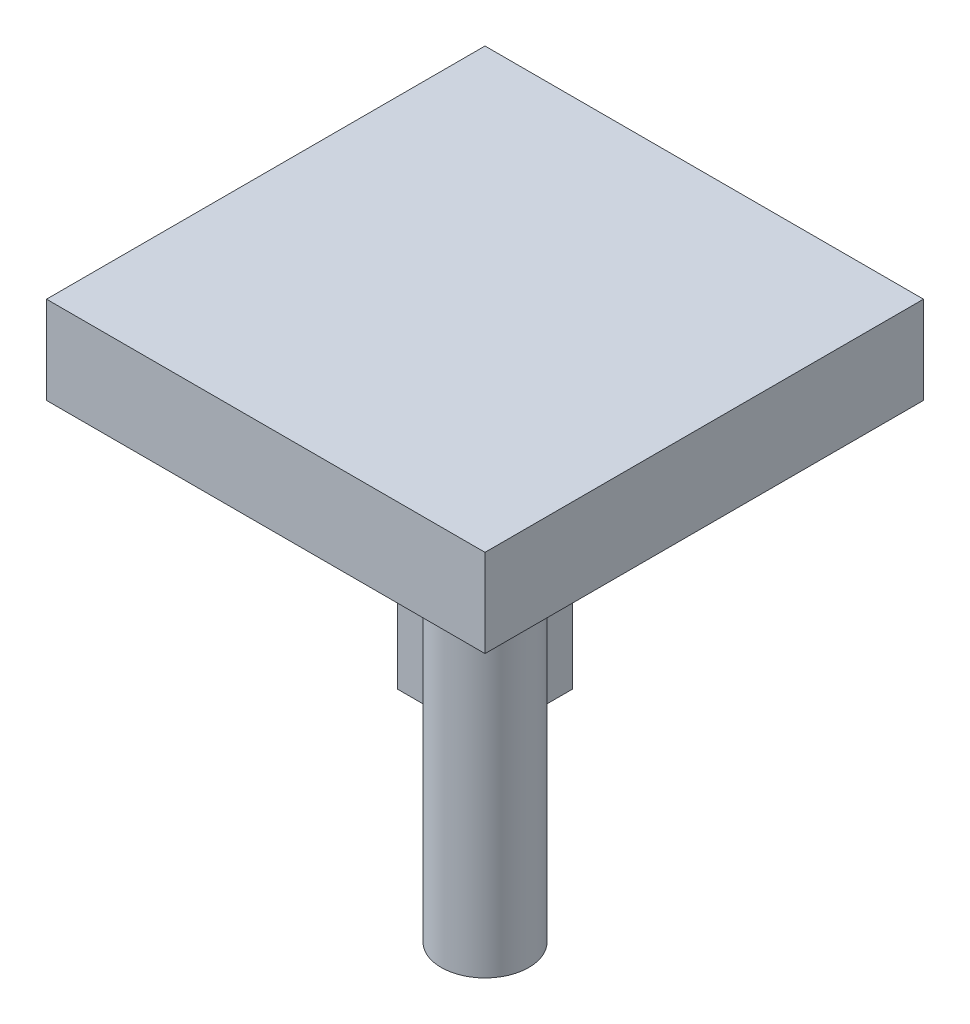
ISO-10303-21;
HEADER;
FILE_DESCRIPTION(('STEP AP214'),'2;1');
FILE_NAME('part.step','',(''),(''),'','','');
FILE_SCHEMA(('AUTOMOTIVE_DESIGN { 1 0 10303 214 1 1 1 1 }'));
ENDSEC;
DATA;
#1=APPLICATION_CONTEXT('core data for automotive mechanical design processes');
#2=APPLICATION_PROTOCOL_DEFINITION('international standard','automotive_design',2000,#1);
#3=PRODUCT_CONTEXT('',#1,'mechanical');
#4=PRODUCT('Part','Part','',(#3));
#5=PRODUCT_RELATED_PRODUCT_CATEGORY('part','',(#4));
#6=PRODUCT_DEFINITION_FORMATION('','',#4);
#7=PRODUCT_DEFINITION_CONTEXT('part definition',#1,'design');
#8=PRODUCT_DEFINITION('design','',#6,#7);
#9=PRODUCT_DEFINITION_SHAPE('','',#8);
#10=(LENGTH_UNIT() NAMED_UNIT(*) SI_UNIT(.MILLI.,.METRE.));
#11=(NAMED_UNIT(*) PLANE_ANGLE_UNIT() SI_UNIT($,.RADIAN.));
#12=(NAMED_UNIT(*) SI_UNIT($,.STERADIAN.) SOLID_ANGLE_UNIT());
#13=UNCERTAINTY_MEASURE_WITH_UNIT(LENGTH_MEASURE(1.E-05),#10,'distance_accuracy_value','');
#14=(GEOMETRIC_REPRESENTATION_CONTEXT(3) GLOBAL_UNCERTAINTY_ASSIGNED_CONTEXT((#13)) GLOBAL_UNIT_ASSIGNED_CONTEXT((#10,
#11,#12)) REPRESENTATION_CONTEXT('',''));
#15=CARTESIAN_POINT('',(0.,0.,0.));
#16=DIRECTION('',(0.,0.,1.));
#17=DIRECTION('',(1.,0.,0.));
#18=AXIS2_PLACEMENT_3D('',#15,#16,#17);
#19=CARTESIAN_POINT('',(-15.,-2.,-35.));
#20=DIRECTION('',(1.,0.,0.));
#21=DIRECTION('',(0.,0.,-1.));
#22=AXIS2_PLACEMENT_3D('',#19,#20,#21);
#23=PLANE('',#22);
#24=DIRECTION('',(0.,0.,1.));
#25=VECTOR('',#24,1.);
#26=CARTESIAN_POINT('',(-15.,-82.,-35.));
#27=LINE('',#26,#25);
#28=CARTESIAN_POINT('',(-15.,-82.,-35.));
#29=VERTEX_POINT('',#28);
#30=CARTESIAN_POINT('',(-15.,-82.,-15.));
#31=VERTEX_POINT('',#30);
#32=EDGE_CURVE('E52',#29,#31,#27,.T.);
#33=ORIENTED_EDGE('',*,*,#32,.F.);
#34=DIRECTION('',(0.,-1.,0.));
#35=VECTOR('',#34,1.);
#36=CARTESIAN_POINT('',(-15.,-2.,-35.));
#37=LINE('',#36,#35);
#38=CARTESIAN_POINT('',(-15.,-2.,-35.));
#39=VERTEX_POINT('',#38);
#40=EDGE_CURVE('E60',#39,#29,#37,.T.);
#41=ORIENTED_EDGE('',*,*,#40,.F.);
#42=DIRECTION('',(0.,0.,1.));
#43=VECTOR('',#42,1.);
#44=CARTESIAN_POINT('',(-15.,-2.,-35.));
#45=LINE('',#44,#43);
#46=CARTESIAN_POINT('',(-15.,-2.,-15.));
#47=VERTEX_POINT('',#46);
#48=EDGE_CURVE('E12',#39,#47,#45,.T.);
#49=ORIENTED_EDGE('',*,*,#48,.T.);
#50=DIRECTION('',(0.,-1.,0.));
#51=VECTOR('',#50,1.);
#52=CARTESIAN_POINT('',(-15.,-2.,-15.));
#53=LINE('',#52,#51);
#54=EDGE_CURVE('E89',#47,#31,#53,.T.);
#55=ORIENTED_EDGE('',*,*,#54,.T.);
#56=EDGE_LOOP('',(#33,#41,#49,#55));
#57=FACE_BOUND('',#56,.T.);
#58=ADVANCED_FACE('F44',(#57),#23,.T.);
#59=CARTESIAN_POINT('',(-35.,-2.,-15.));
#60=DIRECTION('',(0.,0.,1.));
#61=DIRECTION('',(1.,0.,0.));
#62=AXIS2_PLACEMENT_3D('',#59,#60,#61);
#63=PLANE('',#62);
#64=DIRECTION('',(-1.,0.,0.));
#65=VECTOR('',#64,1.);
#66=CARTESIAN_POINT('',(-35.,-82.,-15.));
#67=LINE('',#66,#65);
#68=CARTESIAN_POINT('',(-35.,-82.,-15.));
#69=VERTEX_POINT('',#68);
#70=EDGE_CURVE('E94',#31,#69,#67,.T.);
#71=ORIENTED_EDGE('',*,*,#70,.F.);
#72=ORIENTED_EDGE('',*,*,#54,.F.);
#73=DIRECTION('',(-1.,0.,0.));
#74=VECTOR('',#73,1.);
#75=CARTESIAN_POINT('',(-35.,-2.,-15.));
#76=LINE('',#75,#74);
#77=CARTESIAN_POINT('',(-35.,-2.,-15.));
#78=VERTEX_POINT('',#77);
#79=EDGE_CURVE('E92',#47,#78,#76,.T.);
#80=ORIENTED_EDGE('',*,*,#79,.T.);
#81=DIRECTION('',(0.,-1.,0.));
#82=VECTOR('',#81,1.);
#83=CARTESIAN_POINT('',(-35.,-2.,-15.));
#84=LINE('',#83,#82);
#85=EDGE_CURVE('E46',#78,#69,#84,.T.);
#86=ORIENTED_EDGE('',*,*,#85,.T.);
#87=EDGE_LOOP('',(#71,#72,#80,#86));
#88=FACE_BOUND('',#87,.T.);
#89=ADVANCED_FACE('F91',(#88),#63,.T.);
#90=CARTESIAN_POINT('',(-35.,-2.,-35.));
#91=DIRECTION('',(-1.,0.,0.));
#92=DIRECTION('',(0.,0.,1.));
#93=AXIS2_PLACEMENT_3D('',#90,#91,#92);
#94=PLANE('',#93);
#95=DIRECTION('',(0.,0.,-1.));
#96=VECTOR('',#95,1.);
#97=CARTESIAN_POINT('',(-35.,-82.,-35.));
#98=LINE('',#97,#96);
#99=CARTESIAN_POINT('',(-35.,-82.,-35.));
#100=VERTEX_POINT('',#99);
#101=EDGE_CURVE('E118',#69,#100,#98,.T.);
#102=ORIENTED_EDGE('',*,*,#101,.F.);
#103=ORIENTED_EDGE('',*,*,#85,.F.);
#104=DIRECTION('',(0.,0.,-1.));
#105=VECTOR('',#104,1.);
#106=CARTESIAN_POINT('',(-35.,-2.,-35.));
#107=LINE('',#106,#105);
#108=CARTESIAN_POINT('',(-35.,-2.,-35.));
#109=VERTEX_POINT('',#108);
#110=EDGE_CURVE('E125',#78,#109,#107,.T.);
#111=ORIENTED_EDGE('',*,*,#110,.T.);
#112=DIRECTION('',(0.,-1.,0.));
#113=VECTOR('',#112,1.);
#114=CARTESIAN_POINT('',(-35.,-2.,-35.));
#115=LINE('',#114,#113);
#116=EDGE_CURVE('E77',#109,#100,#115,.T.);
#117=ORIENTED_EDGE('',*,*,#116,.T.);
#118=EDGE_LOOP('',(#102,#103,#111,#117));
#119=FACE_BOUND('',#118,.T.);
#120=ADVANCED_FACE('F103',(#119),#94,.T.);
#121=CARTESIAN_POINT('',(-35.,-2.,-35.));
#122=DIRECTION('',(0.,0.,-1.));
#123=DIRECTION('',(-1.,0.,0.));
#124=AXIS2_PLACEMENT_3D('',#121,#122,#123);
#125=PLANE('',#124);
#126=DIRECTION('',(1.,0.,0.));
#127=VECTOR('',#126,1.);
#128=CARTESIAN_POINT('',(-35.,-82.,-35.));
#129=LINE('',#128,#127);
#130=EDGE_CURVE('E113',#100,#29,#129,.T.);
#131=ORIENTED_EDGE('',*,*,#130,.F.);
#132=ORIENTED_EDGE('',*,*,#116,.F.);
#133=DIRECTION('',(1.,0.,0.));
#134=VECTOR('',#133,1.);
#135=CARTESIAN_POINT('',(-35.,-2.,-35.));
#136=LINE('',#135,#134);
#137=EDGE_CURVE('E126',#109,#39,#136,.T.);
#138=ORIENTED_EDGE('',*,*,#137,.T.);
#139=ORIENTED_EDGE('',*,*,#40,.T.);
#140=EDGE_LOOP('',(#131,#132,#138,#139));
#141=FACE_BOUND('',#140,.T.);
#142=ADVANCED_FACE('F107',(#141),#125,.T.);
#143=OPEN_SHELL('',(#58,#89,#120,#142));
#144=SHELL_BASED_SURFACE_MODEL('B2',(#143));
#145=CARTESIAN_POINT('',(25.,-2.,25.));
#146=DIRECTION('',(0.,-1.,0.));
#147=DIRECTION('',(0.,0.,-1.));
#148=AXIS2_PLACEMENT_3D('',#145,#146,#147);
#149=CYLINDRICAL_SURFACE('',#148,10.);
#150=CARTESIAN_POINT('',(25.,-2.,25.));
#151=DIRECTION('',(0.,-1.,0.));
#152=DIRECTION('',(0.,0.,-1.));
#153=AXIS2_PLACEMENT_3D('',#150,#151,#152);
#154=CIRCLE('',#153,10.);
#155=CARTESIAN_POINT('',(25.,-2.,15.));
#156=VERTEX_POINT('',#155);
#157=EDGE_CURVE('E183',#156,#156,#154,.T.);
#158=ORIENTED_EDGE('',*,*,#157,.T.);
#159=EDGE_LOOP('',(#158));
#160=FACE_BOUND('',#159,.T.);
#161=CARTESIAN_POINT('',(25.,-82.,25.));
#162=DIRECTION('',(0.,-1.,0.));
#163=DIRECTION('',(0.,0.,-1.));
#164=AXIS2_PLACEMENT_3D('',#161,#162,#163);
#165=CIRCLE('',#164,10.);
#166=CARTESIAN_POINT('',(25.,-82.,15.));
#167=VERTEX_POINT('',#166);
#168=EDGE_CURVE('E43',#167,#167,#165,.T.);
#169=ORIENTED_EDGE('',*,*,#168,.F.);
#170=EDGE_LOOP('',(#169));
#171=FACE_BOUND('',#170,.T.);
#172=ADVANCED_FACE('F179',(#160,#171),#149,.T.);
#173=OPEN_SHELL('',(#172));
#174=SHELL_BASED_SURFACE_MODEL('B6',(#173));
#175=CARTESIAN_POINT('',(-50.,20.,-50.));
#176=DIRECTION('',(1.,0.,0.));
#177=DIRECTION('',(0.,0.,-1.));
#178=AXIS2_PLACEMENT_3D('',#175,#176,#177);
#179=PLANE('',#178);
#180=DIRECTION('',(0.,0.,1.));
#181=VECTOR('',#180,1.);
#182=CARTESIAN_POINT('',(-50.,0.,-50.));
#183=LINE('',#182,#181);
#184=CARTESIAN_POINT('',(-50.,0.,-50.));
#185=VERTEX_POINT('',#184);
#186=CARTESIAN_POINT('',(-50.,0.,50.));
#187=VERTEX_POINT('',#186);
#188=EDGE_CURVE('E267',#185,#187,#183,.T.);
#189=ORIENTED_EDGE('',*,*,#188,.T.);
#190=DIRECTION('',(0.,-1.,0.));
#191=VECTOR('',#190,1.);
#192=CARTESIAN_POINT('',(-50.,20.,50.));
#193=LINE('',#192,#191);
#194=CARTESIAN_POINT('',(-50.,20.,50.));
#195=VERTEX_POINT('',#194);
#196=EDGE_CURVE('E177',#195,#187,#193,.T.);
#197=ORIENTED_EDGE('',*,*,#196,.F.);
#198=DIRECTION('',(0.,0.,1.));
#199=VECTOR('',#198,1.);
#200=CARTESIAN_POINT('',(-50.,20.,-50.));
#201=LINE('',#200,#199);
#202=CARTESIAN_POINT('',(-50.,20.,-50.));
#203=VERTEX_POINT('',#202);
#204=EDGE_CURVE('E255',#203,#195,#201,.T.);
#205=ORIENTED_EDGE('',*,*,#204,.F.);
#206=DIRECTION('',(0.,-1.,0.));
#207=VECTOR('',#206,1.);
#208=CARTESIAN_POINT('',(-50.,20.,-50.));
#209=LINE('',#208,#207);
#210=EDGE_CURVE('E263',#203,#185,#209,.T.);
#211=ORIENTED_EDGE('',*,*,#210,.T.);
#212=EDGE_LOOP('',(#189,#197,#205,#211));
#213=FACE_BOUND('',#212,.T.);
#214=ADVANCED_FACE('F204',(#213),#179,.F.);
#215=CARTESIAN_POINT('',(50.,20.,50.));
#216=DIRECTION('',(0.,0.,-1.));
#217=DIRECTION('',(-1.,0.,0.));
#218=AXIS2_PLACEMENT_3D('',#215,#216,#217);
#219=PLANE('',#218);
#220=DIRECTION('',(1.,0.,0.));
#221=VECTOR('',#220,1.);
#222=CARTESIAN_POINT('',(50.,0.,50.));
#223=LINE('',#222,#221);
#224=CARTESIAN_POINT('',(50.,0.,50.));
#225=VERTEX_POINT('',#224);
#226=EDGE_CURVE('E259',#187,#225,#223,.T.);
#227=ORIENTED_EDGE('',*,*,#226,.T.);
#228=DIRECTION('',(0.,-1.,0.));
#229=VECTOR('',#228,1.);
#230=CARTESIAN_POINT('',(50.,20.,50.));
#231=LINE('',#230,#229);
#232=CARTESIAN_POINT('',(50.,20.,50.));
#233=VERTEX_POINT('',#232);
#234=EDGE_CURVE('E212',#233,#225,#231,.T.);
#235=ORIENTED_EDGE('',*,*,#234,.F.);
#236=DIRECTION('',(1.,0.,0.));
#237=VECTOR('',#236,1.);
#238=CARTESIAN_POINT('',(50.,20.,50.));
#239=LINE('',#238,#237);
#240=EDGE_CURVE('E250',#195,#233,#239,.T.);
#241=ORIENTED_EDGE('',*,*,#240,.F.);
#242=ORIENTED_EDGE('',*,*,#196,.T.);
#243=EDGE_LOOP('',(#227,#235,#241,#242));
#244=FACE_BOUND('',#243,.T.);
#245=ADVANCED_FACE('F258',(#244),#219,.F.);
#246=CARTESIAN_POINT('',(50.,20.,-50.));
#247=DIRECTION('',(-1.,0.,0.));
#248=DIRECTION('',(0.,0.,1.));
#249=AXIS2_PLACEMENT_3D('',#246,#247,#248);
#250=PLANE('',#249);
#251=DIRECTION('',(0.,0.,-1.));
#252=VECTOR('',#251,1.);
#253=CARTESIAN_POINT('',(50.,0.,-50.));
#254=LINE('',#253,#252);
#255=CARTESIAN_POINT('',(50.,0.,-50.));
#256=VERTEX_POINT('',#255);
#257=EDGE_CURVE('E237',#225,#256,#254,.T.);
#258=ORIENTED_EDGE('',*,*,#257,.T.);
#259=DIRECTION('',(0.,-1.,0.));
#260=VECTOR('',#259,1.);
#261=CARTESIAN_POINT('',(50.,20.,-50.));
#262=LINE('',#261,#260);
#263=CARTESIAN_POINT('',(50.,20.,-50.));
#264=VERTEX_POINT('',#263);
#265=EDGE_CURVE('E260',#264,#256,#262,.T.);
#266=ORIENTED_EDGE('',*,*,#265,.F.);
#267=DIRECTION('',(0.,0.,-1.));
#268=VECTOR('',#267,1.);
#269=CARTESIAN_POINT('',(50.,20.,-50.));
#270=LINE('',#269,#268);
#271=EDGE_CURVE('E253',#233,#264,#270,.T.);
#272=ORIENTED_EDGE('',*,*,#271,.F.);
#273=ORIENTED_EDGE('',*,*,#234,.T.);
#274=EDGE_LOOP('',(#258,#266,#272,#273));
#275=FACE_BOUND('',#274,.T.);
#276=ADVANCED_FACE('F261',(#275),#250,.F.);
#277=CARTESIAN_POINT('',(50.,20.,-50.));
#278=DIRECTION('',(0.,0.,1.));
#279=DIRECTION('',(1.,0.,0.));
#280=AXIS2_PLACEMENT_3D('',#277,#278,#279);
#281=PLANE('',#280);
#282=DIRECTION('',(-1.,0.,0.));
#283=VECTOR('',#282,1.);
#284=CARTESIAN_POINT('',(50.,0.,-50.));
#285=LINE('',#284,#283);
#286=EDGE_CURVE('E243',#256,#185,#285,.T.);
#287=ORIENTED_EDGE('',*,*,#286,.T.);
#288=ORIENTED_EDGE('',*,*,#210,.F.);
#289=DIRECTION('',(-1.,0.,0.));
#290=VECTOR('',#289,1.);
#291=CARTESIAN_POINT('',(50.,20.,-50.));
#292=LINE('',#291,#290);
#293=EDGE_CURVE('E220',#264,#203,#292,.T.);
#294=ORIENTED_EDGE('',*,*,#293,.F.);
#295=ORIENTED_EDGE('',*,*,#265,.T.);
#296=EDGE_LOOP('',(#287,#288,#294,#295));
#297=FACE_BOUND('',#296,.T.);
#298=ADVANCED_FACE('F274',(#297),#281,.F.);
#299=CARTESIAN_POINT('',(0.,20.,0.));
#300=DIRECTION('',(0.,-1.,0.));
#301=DIRECTION('',(0.,0.,-1.));
#302=AXIS2_PLACEMENT_3D('',#299,#300,#301);
#303=PLANE('',#302);
#304=ORIENTED_EDGE('',*,*,#204,.T.);
#305=ORIENTED_EDGE('',*,*,#240,.T.);
#306=ORIENTED_EDGE('',*,*,#271,.T.);
#307=ORIENTED_EDGE('',*,*,#293,.T.);
#308=EDGE_LOOP('',(#304,#305,#306,#307));
#309=FACE_BOUND('',#308,.T.);
#310=ADVANCED_FACE('F251',(#309),#303,.F.);
#311=CARTESIAN_POINT('',(0.,0.,0.));
#312=DIRECTION('',(0.,-1.,0.));
#313=DIRECTION('',(0.,0.,-1.));
#314=AXIS2_PLACEMENT_3D('',#311,#312,#313);
#315=PLANE('',#314);
#316=ORIENTED_EDGE('',*,*,#188,.F.);
#317=ORIENTED_EDGE('',*,*,#286,.F.);
#318=ORIENTED_EDGE('',*,*,#257,.F.);
#319=ORIENTED_EDGE('',*,*,#226,.F.);
#320=EDGE_LOOP('',(#316,#317,#318,#319));
#321=FACE_BOUND('',#320,.T.);
#322=ADVANCED_FACE('F277',(#321),#315,.T.);
#323=CLOSED_SHELL('',(#214,#245,#276,#298,#310,#322));
#324=MANIFOLD_SOLID_BREP('B38',#323);
#325=ADVANCED_BREP_SHAPE_REPRESENTATION('',(#18,#324),#14);
#326=MANIFOLD_SURFACE_SHAPE_REPRESENTATION('',(#18,#144,#174),#14);
#327=SHAPE_REPRESENTATION('',(#18),#14);
#328=SHAPE_DEFINITION_REPRESENTATION(#9,#327);
#329=SHAPE_REPRESENTATION_RELATIONSHIP('','',#327,#325);
#330=SHAPE_REPRESENTATION_RELATIONSHIP('','',#327,#326);
ENDSEC;
END-ISO-10303-21;
